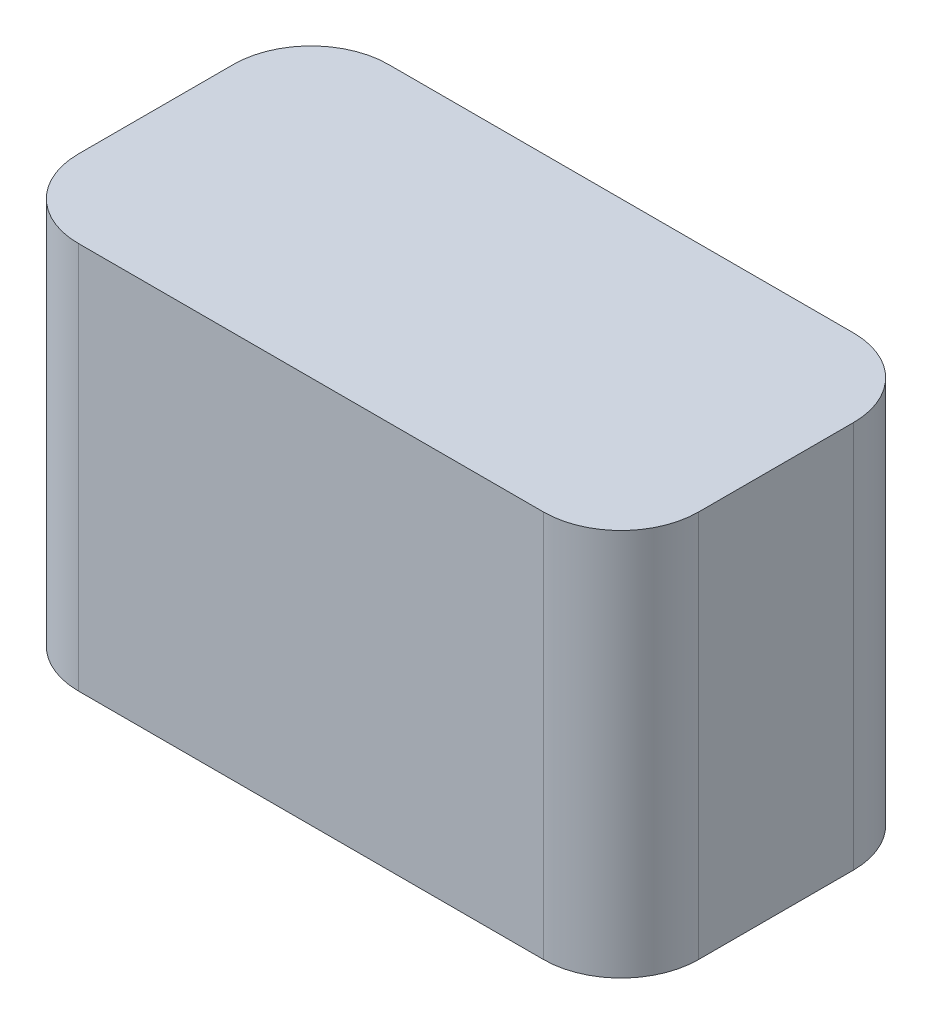
ISO-10303-21;
HEADER;
FILE_DESCRIPTION(('STEP AP214'),'2;1');
FILE_NAME('part.step','',(''),(''),'','','');
FILE_SCHEMA(('AUTOMOTIVE_DESIGN { 1 0 10303 214 1 1 1 1 }'));
ENDSEC;
DATA;
#1=APPLICATION_CONTEXT('core data for automotive mechanical design processes');
#2=APPLICATION_PROTOCOL_DEFINITION('international standard','automotive_design',2000,#1);
#3=PRODUCT_CONTEXT('',#1,'mechanical');
#4=PRODUCT('Part','Part','',(#3));
#5=PRODUCT_RELATED_PRODUCT_CATEGORY('part','',(#4));
#6=PRODUCT_DEFINITION_FORMATION('','',#4);
#7=PRODUCT_DEFINITION_CONTEXT('part definition',#1,'design');
#8=PRODUCT_DEFINITION('design','',#6,#7);
#9=PRODUCT_DEFINITION_SHAPE('','',#8);
#10=(LENGTH_UNIT() NAMED_UNIT(*) SI_UNIT(.MILLI.,.METRE.));
#11=(NAMED_UNIT(*) PLANE_ANGLE_UNIT() SI_UNIT($,.RADIAN.));
#12=(NAMED_UNIT(*) SI_UNIT($,.STERADIAN.) SOLID_ANGLE_UNIT());
#13=UNCERTAINTY_MEASURE_WITH_UNIT(LENGTH_MEASURE(1.E-05),#10,'distance_accuracy_value','');
#14=(GEOMETRIC_REPRESENTATION_CONTEXT(3) GLOBAL_UNCERTAINTY_ASSIGNED_CONTEXT((#13)) GLOBAL_UNIT_ASSIGNED_CONTEXT((#10,
#11,#12)) REPRESENTATION_CONTEXT('',''));
#15=CARTESIAN_POINT('',(0.,0.,0.));
#16=DIRECTION('',(0.,0.,1.));
#17=DIRECTION('',(1.,0.,0.));
#18=AXIS2_PLACEMENT_3D('',#15,#16,#17);
#19=CARTESIAN_POINT('',(-3.,5.,-1.));
#20=DIRECTION('',(0.,-1.,0.));
#21=DIRECTION('',(0.,0.,-1.));
#22=AXIS2_PLACEMENT_3D('',#19,#20,#21);
#23=CYLINDRICAL_SURFACE('',#22,1.);
#24=CARTESIAN_POINT('',(-3.,0.,-1.));
#25=DIRECTION('',(0.,1.,0.));
#26=DIRECTION('',(0.,0.,1.));
#27=AXIS2_PLACEMENT_3D('',#24,#25,#26);
#28=CIRCLE('',#27,1.);
#29=CARTESIAN_POINT('',(-2.99999999999999,0.,-2.));
#30=VERTEX_POINT('',#29);
#31=CARTESIAN_POINT('',(-4.,0.,-0.999999999999994));
#32=VERTEX_POINT('',#31);
#33=EDGE_CURVE('E130',#30,#32,#28,.T.);
#34=ORIENTED_EDGE('',*,*,#33,.T.);
#35=DIRECTION('',(0.,-1.,0.));
#36=VECTOR('',#35,1.);
#37=CARTESIAN_POINT('',(-4.,5.,-0.999999999999994));
#38=LINE('',#37,#36);
#39=CARTESIAN_POINT('',(-4.,5.,-0.999999999999994));
#40=VERTEX_POINT('',#39);
#41=EDGE_CURVE('E11',#40,#32,#38,.T.);
#42=ORIENTED_EDGE('',*,*,#41,.F.);
#43=CARTESIAN_POINT('',(-3.,5.,-1.));
#44=DIRECTION('',(0.,1.,0.));
#45=DIRECTION('',(0.,0.,1.));
#46=AXIS2_PLACEMENT_3D('',#43,#44,#45);
#47=CIRCLE('',#46,1.);
#48=CARTESIAN_POINT('',(-2.99999999999999,5.,-2.));
#49=VERTEX_POINT('',#48);
#50=EDGE_CURVE('E144',#49,#40,#47,.T.);
#51=ORIENTED_EDGE('',*,*,#50,.F.);
#52=DIRECTION('',(0.,-1.,0.));
#53=VECTOR('',#52,1.);
#54=CARTESIAN_POINT('',(-2.99999999999999,5.,-2.));
#55=LINE('',#54,#53);
#56=EDGE_CURVE('E126',#49,#30,#55,.T.);
#57=ORIENTED_EDGE('',*,*,#56,.T.);
#58=EDGE_LOOP('',(#34,#42,#51,#57));
#59=FACE_BOUND('',#58,.T.);
#60=ADVANCED_FACE('F34',(#59),#23,.T.);
#61=CARTESIAN_POINT('',(-4.,5.,-0.999999999999994));
#62=DIRECTION('',(1.,0.,0.));
#63=DIRECTION('',(0.,0.,-1.));
#64=AXIS2_PLACEMENT_3D('',#61,#62,#63);
#65=PLANE('',#64);
#66=DIRECTION('',(0.,0.,1.));
#67=VECTOR('',#66,1.);
#68=CARTESIAN_POINT('',(-4.,0.,-0.999999999999994));
#69=LINE('',#68,#67);
#70=CARTESIAN_POINT('',(-4.,0.,0.999999999999992));
#71=VERTEX_POINT('',#70);
#72=EDGE_CURVE('E133',#32,#71,#69,.T.);
#73=ORIENTED_EDGE('',*,*,#72,.T.);
#74=DIRECTION('',(0.,-1.,0.));
#75=VECTOR('',#74,1.);
#76=CARTESIAN_POINT('',(-4.,5.,0.999999999999992));
#77=LINE('',#76,#75);
#78=CARTESIAN_POINT('',(-4.,5.,0.999999999999992));
#79=VERTEX_POINT('',#78);
#80=EDGE_CURVE('E42',#79,#71,#77,.T.);
#81=ORIENTED_EDGE('',*,*,#80,.F.);
#82=DIRECTION('',(0.,0.,1.));
#83=VECTOR('',#82,1.);
#84=CARTESIAN_POINT('',(-4.,5.,-0.999999999999994));
#85=LINE('',#84,#83);
#86=EDGE_CURVE('E93',#40,#79,#85,.T.);
#87=ORIENTED_EDGE('',*,*,#86,.F.);
#88=ORIENTED_EDGE('',*,*,#41,.T.);
#89=EDGE_LOOP('',(#73,#81,#87,#88));
#90=FACE_BOUND('',#89,.T.);
#91=ADVANCED_FACE('F179',(#90),#65,.F.);
#92=CARTESIAN_POINT('',(-3.,5.,0.999999999999999));
#93=DIRECTION('',(0.,-1.,0.));
#94=DIRECTION('',(0.,0.,-1.));
#95=AXIS2_PLACEMENT_3D('',#92,#93,#94);
#96=CYLINDRICAL_SURFACE('',#95,1.);
#97=CARTESIAN_POINT('',(-3.,0.,0.999999999999999));
#98=DIRECTION('',(0.,1.,0.));
#99=DIRECTION('',(0.,0.,1.));
#100=AXIS2_PLACEMENT_3D('',#97,#98,#99);
#101=CIRCLE('',#100,1.);
#102=CARTESIAN_POINT('',(-2.99999999999999,0.,2.));
#103=VERTEX_POINT('',#102);
#104=EDGE_CURVE('E135',#71,#103,#101,.T.);
#105=ORIENTED_EDGE('',*,*,#104,.T.);
#106=DIRECTION('',(0.,-1.,0.));
#107=VECTOR('',#106,1.);
#108=CARTESIAN_POINT('',(-2.99999999999999,5.,2.));
#109=LINE('',#108,#107);
#110=CARTESIAN_POINT('',(-2.99999999999999,5.,2.));
#111=VERTEX_POINT('',#110);
#112=EDGE_CURVE('E151',#111,#103,#109,.T.);
#113=ORIENTED_EDGE('',*,*,#112,.F.);
#114=CARTESIAN_POINT('',(-3.,5.,0.999999999999999));
#115=DIRECTION('',(0.,1.,0.));
#116=DIRECTION('',(0.,0.,1.));
#117=AXIS2_PLACEMENT_3D('',#114,#115,#116);
#118=CIRCLE('',#117,1.);
#119=EDGE_CURVE('E159',#79,#111,#118,.T.);
#120=ORIENTED_EDGE('',*,*,#119,.F.);
#121=ORIENTED_EDGE('',*,*,#80,.T.);
#122=EDGE_LOOP('',(#105,#113,#120,#121));
#123=FACE_BOUND('',#122,.T.);
#124=ADVANCED_FACE('F157',(#123),#96,.T.);
#125=CARTESIAN_POINT('',(-2.99999999999999,5.,2.));
#126=DIRECTION('',(0.,0.,-1.));
#127=DIRECTION('',(-1.,0.,0.));
#128=AXIS2_PLACEMENT_3D('',#125,#126,#127);
#129=PLANE('',#128);
#130=DIRECTION('',(1.,0.,0.));
#131=VECTOR('',#130,1.);
#132=CARTESIAN_POINT('',(-2.99999999999999,0.,2.));
#133=LINE('',#132,#131);
#134=CARTESIAN_POINT('',(2.99999999999999,0.,2.));
#135=VERTEX_POINT('',#134);
#136=EDGE_CURVE('E137',#103,#135,#133,.T.);
#137=ORIENTED_EDGE('',*,*,#136,.T.);
#138=DIRECTION('',(0.,-1.,0.));
#139=VECTOR('',#138,1.);
#140=CARTESIAN_POINT('',(2.99999999999999,5.,2.));
#141=LINE('',#140,#139);
#142=CARTESIAN_POINT('',(2.99999999999999,5.,2.));
#143=VERTEX_POINT('',#142);
#144=EDGE_CURVE('E148',#143,#135,#141,.T.);
#145=ORIENTED_EDGE('',*,*,#144,.F.);
#146=DIRECTION('',(1.,0.,0.));
#147=VECTOR('',#146,1.);
#148=CARTESIAN_POINT('',(-2.99999999999999,5.,2.));
#149=LINE('',#148,#147);
#150=EDGE_CURVE('E171',#111,#143,#149,.T.);
#151=ORIENTED_EDGE('',*,*,#150,.F.);
#152=ORIENTED_EDGE('',*,*,#112,.T.);
#153=EDGE_LOOP('',(#137,#145,#151,#152));
#154=FACE_BOUND('',#153,.T.);
#155=ADVANCED_FACE('F167',(#154),#129,.F.);
#156=CARTESIAN_POINT('',(3.,5.,0.999999999999999));
#157=DIRECTION('',(0.,-1.,0.));
#158=DIRECTION('',(0.,0.,-1.));
#159=AXIS2_PLACEMENT_3D('',#156,#157,#158);
#160=CYLINDRICAL_SURFACE('',#159,1.);
#161=CARTESIAN_POINT('',(3.,0.,0.999999999999999));
#162=DIRECTION('',(0.,1.,0.));
#163=DIRECTION('',(0.,0.,-1.));
#164=AXIS2_PLACEMENT_3D('',#161,#162,#163);
#165=CIRCLE('',#164,1.);
#166=CARTESIAN_POINT('',(4.,0.,0.999999999999992));
#167=VERTEX_POINT('',#166);
#168=EDGE_CURVE('E139',#135,#167,#165,.T.);
#169=ORIENTED_EDGE('',*,*,#168,.T.);
#170=DIRECTION('',(0.,-1.,0.));
#171=VECTOR('',#170,1.);
#172=CARTESIAN_POINT('',(4.,5.,0.999999999999992));
#173=LINE('',#172,#171);
#174=CARTESIAN_POINT('',(4.,5.,0.999999999999992));
#175=VERTEX_POINT('',#174);
#176=EDGE_CURVE('E121',#175,#167,#173,.T.);
#177=ORIENTED_EDGE('',*,*,#176,.F.);
#178=CARTESIAN_POINT('',(3.,5.,0.999999999999999));
#179=DIRECTION('',(0.,1.,0.));
#180=DIRECTION('',(0.,0.,-1.));
#181=AXIS2_PLACEMENT_3D('',#178,#179,#180);
#182=CIRCLE('',#181,1.);
#183=EDGE_CURVE('E112',#143,#175,#182,.T.);
#184=ORIENTED_EDGE('',*,*,#183,.F.);
#185=ORIENTED_EDGE('',*,*,#144,.T.);
#186=EDGE_LOOP('',(#169,#177,#184,#185));
#187=FACE_BOUND('',#186,.T.);
#188=ADVANCED_FACE('F170',(#187),#160,.T.);
#189=CARTESIAN_POINT('',(4.,5.,-0.999999999999994));
#190=DIRECTION('',(-1.,0.,0.));
#191=DIRECTION('',(0.,0.,1.));
#192=AXIS2_PLACEMENT_3D('',#189,#190,#191);
#193=PLANE('',#192);
#194=DIRECTION('',(0.,0.,-1.));
#195=VECTOR('',#194,1.);
#196=CARTESIAN_POINT('',(4.,0.,-0.999999999999994));
#197=LINE('',#196,#195);
#198=CARTESIAN_POINT('',(4.,0.,-0.999999999999994));
#199=VERTEX_POINT('',#198);
#200=EDGE_CURVE('E120',#167,#199,#197,.T.);
#201=ORIENTED_EDGE('',*,*,#200,.T.);
#202=DIRECTION('',(0.,-1.,0.));
#203=VECTOR('',#202,1.);
#204=CARTESIAN_POINT('',(4.,5.,-0.999999999999994));
#205=LINE('',#204,#203);
#206=CARTESIAN_POINT('',(4.,5.,-0.999999999999994));
#207=VERTEX_POINT('',#206);
#208=EDGE_CURVE('E117',#207,#199,#205,.T.);
#209=ORIENTED_EDGE('',*,*,#208,.F.);
#210=DIRECTION('',(0.,0.,-1.));
#211=VECTOR('',#210,1.);
#212=CARTESIAN_POINT('',(4.,5.,-0.999999999999994));
#213=LINE('',#212,#211);
#214=EDGE_CURVE('E106',#175,#207,#213,.T.);
#215=ORIENTED_EDGE('',*,*,#214,.F.);
#216=ORIENTED_EDGE('',*,*,#176,.T.);
#217=EDGE_LOOP('',(#201,#209,#215,#216));
#218=FACE_BOUND('',#217,.T.);
#219=ADVANCED_FACE('F118',(#218),#193,.F.);
#220=CARTESIAN_POINT('',(3.,5.,-1.));
#221=DIRECTION('',(0.,-1.,0.));
#222=DIRECTION('',(0.,0.,-1.));
#223=AXIS2_PLACEMENT_3D('',#220,#221,#222);
#224=CYLINDRICAL_SURFACE('',#223,1.);
#225=CARTESIAN_POINT('',(3.,0.,-1.));
#226=DIRECTION('',(0.,1.,0.));
#227=DIRECTION('',(0.,0.,-1.));
#228=AXIS2_PLACEMENT_3D('',#225,#226,#227);
#229=CIRCLE('',#228,1.);
#230=CARTESIAN_POINT('',(2.99999999999999,0.,-2.));
#231=VERTEX_POINT('',#230);
#232=EDGE_CURVE('E79',#199,#231,#229,.T.);
#233=ORIENTED_EDGE('',*,*,#232,.T.);
#234=DIRECTION('',(0.,-1.,0.));
#235=VECTOR('',#234,1.);
#236=CARTESIAN_POINT('',(2.99999999999999,5.,-2.));
#237=LINE('',#236,#235);
#238=CARTESIAN_POINT('',(2.99999999999999,5.,-2.));
#239=VERTEX_POINT('',#238);
#240=EDGE_CURVE('E122',#239,#231,#237,.T.);
#241=ORIENTED_EDGE('',*,*,#240,.F.);
#242=CARTESIAN_POINT('',(3.,5.,-1.));
#243=DIRECTION('',(0.,1.,0.));
#244=DIRECTION('',(0.,0.,-1.));
#245=AXIS2_PLACEMENT_3D('',#242,#243,#244);
#246=CIRCLE('',#245,1.);
#247=EDGE_CURVE('E110',#207,#239,#246,.T.);
#248=ORIENTED_EDGE('',*,*,#247,.F.);
#249=ORIENTED_EDGE('',*,*,#208,.T.);
#250=EDGE_LOOP('',(#233,#241,#248,#249));
#251=FACE_BOUND('',#250,.T.);
#252=ADVANCED_FACE('F124',(#251),#224,.T.);
#253=CARTESIAN_POINT('',(-2.99999999999999,5.,-2.));
#254=DIRECTION('',(0.,0.,1.));
#255=DIRECTION('',(1.,0.,0.));
#256=AXIS2_PLACEMENT_3D('',#253,#254,#255);
#257=PLANE('',#256);
#258=DIRECTION('',(-1.,0.,0.));
#259=VECTOR('',#258,1.);
#260=CARTESIAN_POINT('',(-2.99999999999999,0.,-2.));
#261=LINE('',#260,#259);
#262=EDGE_CURVE('E85',#231,#30,#261,.T.);
#263=ORIENTED_EDGE('',*,*,#262,.T.);
#264=ORIENTED_EDGE('',*,*,#56,.F.);
#265=DIRECTION('',(-1.,0.,0.));
#266=VECTOR('',#265,1.);
#267=CARTESIAN_POINT('',(-2.99999999999999,5.,-2.));
#268=LINE('',#267,#266);
#269=EDGE_CURVE('E50',#239,#49,#268,.T.);
#270=ORIENTED_EDGE('',*,*,#269,.F.);
#271=ORIENTED_EDGE('',*,*,#240,.T.);
#272=EDGE_LOOP('',(#263,#264,#270,#271));
#273=FACE_BOUND('',#272,.T.);
#274=ADVANCED_FACE('F195',(#273),#257,.F.);
#275=CARTESIAN_POINT('',(-3.,5.,-1.));
#276=DIRECTION('',(0.,1.,0.));
#277=DIRECTION('',(0.,0.,1.));
#278=AXIS2_PLACEMENT_3D('',#275,#276,#277);
#279=PLANE('',#278);
#280=ORIENTED_EDGE('',*,*,#50,.T.);
#281=ORIENTED_EDGE('',*,*,#86,.T.);
#282=ORIENTED_EDGE('',*,*,#119,.T.);
#283=ORIENTED_EDGE('',*,*,#150,.T.);
#284=ORIENTED_EDGE('',*,*,#183,.T.);
#285=ORIENTED_EDGE('',*,*,#214,.T.);
#286=ORIENTED_EDGE('',*,*,#247,.T.);
#287=ORIENTED_EDGE('',*,*,#269,.T.);
#288=EDGE_LOOP('',(#280,#281,#282,#283,#284,#285,#286,#287));
#289=FACE_BOUND('',#288,.T.);
#290=ADVANCED_FACE('F108',(#289),#279,.T.);
#291=CARTESIAN_POINT('',(-3.,0.,-1.));
#292=DIRECTION('',(0.,1.,0.));
#293=DIRECTION('',(0.,0.,1.));
#294=AXIS2_PLACEMENT_3D('',#291,#292,#293);
#295=PLANE('',#294);
#296=ORIENTED_EDGE('',*,*,#33,.F.);
#297=ORIENTED_EDGE('',*,*,#262,.F.);
#298=ORIENTED_EDGE('',*,*,#232,.F.);
#299=ORIENTED_EDGE('',*,*,#200,.F.);
#300=ORIENTED_EDGE('',*,*,#168,.F.);
#301=ORIENTED_EDGE('',*,*,#136,.F.);
#302=ORIENTED_EDGE('',*,*,#104,.F.);
#303=ORIENTED_EDGE('',*,*,#72,.F.);
#304=EDGE_LOOP('',(#296,#297,#298,#299,#300,#301,#302,#303));
#305=FACE_BOUND('',#304,.T.);
#306=ADVANCED_FACE('F163',(#305),#295,.F.);
#307=CLOSED_SHELL('',(#60,#91,#124,#155,#188,#219,#252,#274,#290,#306));
#308=MANIFOLD_SOLID_BREP('B2',#307);
#309=ADVANCED_BREP_SHAPE_REPRESENTATION('',(#18,#308),#14);
#310=SHAPE_DEFINITION_REPRESENTATION(#9,#309);
ENDSEC;
END-ISO-10303-21;
